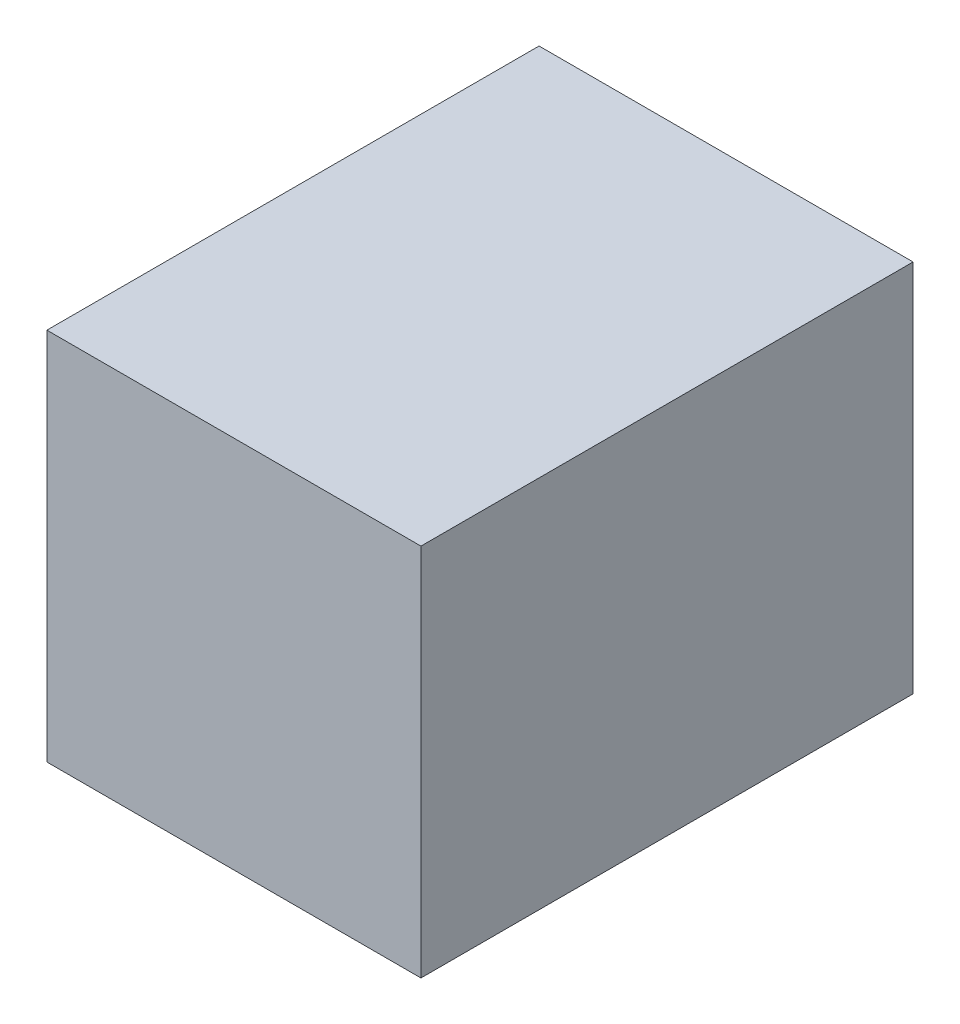
ISO-10303-21;
HEADER;
FILE_DESCRIPTION(('STEP AP214'),'2;1');
FILE_NAME('part.step','',(''),(''),'','','');
FILE_SCHEMA(('AUTOMOTIVE_DESIGN { 1 0 10303 214 1 1 1 1 }'));
ENDSEC;
DATA;
#1=APPLICATION_CONTEXT('core data for automotive mechanical design processes');
#2=APPLICATION_PROTOCOL_DEFINITION('international standard','automotive_design',2000,#1);
#3=PRODUCT_CONTEXT('',#1,'mechanical');
#4=PRODUCT('Part','Part','',(#3));
#5=PRODUCT_RELATED_PRODUCT_CATEGORY('part','',(#4));
#6=PRODUCT_DEFINITION_FORMATION('','',#4);
#7=PRODUCT_DEFINITION_CONTEXT('part definition',#1,'design');
#8=PRODUCT_DEFINITION('design','',#6,#7);
#9=PRODUCT_DEFINITION_SHAPE('','',#8);
#10=(LENGTH_UNIT() NAMED_UNIT(*) SI_UNIT(.MILLI.,.METRE.));
#11=(NAMED_UNIT(*) PLANE_ANGLE_UNIT() SI_UNIT($,.RADIAN.));
#12=(NAMED_UNIT(*) SI_UNIT($,.STERADIAN.) SOLID_ANGLE_UNIT());
#13=UNCERTAINTY_MEASURE_WITH_UNIT(LENGTH_MEASURE(1.E-05),#10,'distance_accuracy_value','');
#14=(GEOMETRIC_REPRESENTATION_CONTEXT(3) GLOBAL_UNCERTAINTY_ASSIGNED_CONTEXT((#13)) GLOBAL_UNIT_ASSIGNED_CONTEXT((#10,
#11,#12)) REPRESENTATION_CONTEXT('',''));
#15=CARTESIAN_POINT('',(0.,0.,0.));
#16=DIRECTION('',(0.,0.,1.));
#17=DIRECTION('',(1.,0.,0.));
#18=AXIS2_PLACEMENT_3D('',#15,#16,#17);
#19=CARTESIAN_POINT('',(-259.500000000003,209.999999999999,12.5));
#20=DIRECTION('',(0.,1.,0.));
#21=DIRECTION('',(0.,0.,1.));
#22=AXIS2_PLACEMENT_3D('',#19,#20,#21);
#23=PLANE('',#22);
#24=DIRECTION('',(1.,0.,0.));
#25=VECTOR('',#24,1.);
#26=CARTESIAN_POINT('',(-259.500000000003,209.999999999999,-12.5));
#27=LINE('',#26,#25);
#28=CARTESIAN_POINT('',(-259.500000000003,209.999999999999,-12.5));
#29=VERTEX_POINT('',#28);
#30=CARTESIAN_POINT('',(-240.500000000003,209.999999999999,-12.5));
#31=VERTEX_POINT('',#30);
#32=EDGE_CURVE('E102',#29,#31,#27,.T.);
#33=ORIENTED_EDGE('',*,*,#32,.T.);
#34=DIRECTION('',(0.,0.,-1.));
#35=VECTOR('',#34,1.);
#36=CARTESIAN_POINT('',(-240.500000000003,209.999999999999,12.5));
#37=LINE('',#36,#35);
#38=CARTESIAN_POINT('',(-240.500000000003,209.999999999999,12.5));
#39=VERTEX_POINT('',#38);
#40=EDGE_CURVE('E11',#39,#31,#37,.T.);
#41=ORIENTED_EDGE('',*,*,#40,.F.);
#42=DIRECTION('',(1.,0.,0.));
#43=VECTOR('',#42,1.);
#44=CARTESIAN_POINT('',(-259.500000000003,209.999999999999,12.5));
#45=LINE('',#44,#43);
#46=CARTESIAN_POINT('',(-259.500000000003,209.999999999999,12.5));
#47=VERTEX_POINT('',#46);
#48=EDGE_CURVE('E90',#47,#39,#45,.T.);
#49=ORIENTED_EDGE('',*,*,#48,.F.);
#50=DIRECTION('',(0.,0.,-1.));
#51=VECTOR('',#50,1.);
#52=CARTESIAN_POINT('',(-259.500000000003,209.999999999999,12.5));
#53=LINE('',#52,#51);
#54=EDGE_CURVE('E98',#47,#29,#53,.T.);
#55=ORIENTED_EDGE('',*,*,#54,.T.);
#56=EDGE_LOOP('',(#33,#41,#49,#55));
#57=FACE_BOUND('',#56,.T.);
#58=ADVANCED_FACE('F39',(#57),#23,.F.);
#59=CARTESIAN_POINT('',(-240.500000000003,209.999999999999,12.5));
#60=DIRECTION('',(-1.,0.,0.));
#61=DIRECTION('',(0.,0.,1.));
#62=AXIS2_PLACEMENT_3D('',#59,#60,#61);
#63=PLANE('',#62);
#64=DIRECTION('',(0.,1.,0.));
#65=VECTOR('',#64,1.);
#66=CARTESIAN_POINT('',(-240.500000000003,209.999999999999,-12.5));
#67=LINE('',#66,#65);
#68=CARTESIAN_POINT('',(-240.500000000003,228.999999999999,-12.5));
#69=VERTEX_POINT('',#68);
#70=EDGE_CURVE('E94',#31,#69,#67,.T.);
#71=ORIENTED_EDGE('',*,*,#70,.T.);
#72=DIRECTION('',(0.,0.,-1.));
#73=VECTOR('',#72,1.);
#74=CARTESIAN_POINT('',(-240.500000000003,228.999999999999,12.5));
#75=LINE('',#74,#73);
#76=CARTESIAN_POINT('',(-240.500000000003,228.999999999999,12.5));
#77=VERTEX_POINT('',#76);
#78=EDGE_CURVE('E47',#77,#69,#75,.T.);
#79=ORIENTED_EDGE('',*,*,#78,.F.);
#80=DIRECTION('',(0.,1.,0.));
#81=VECTOR('',#80,1.);
#82=CARTESIAN_POINT('',(-240.500000000003,209.999999999999,12.5));
#83=LINE('',#82,#81);
#84=EDGE_CURVE('E85',#39,#77,#83,.T.);
#85=ORIENTED_EDGE('',*,*,#84,.F.);
#86=ORIENTED_EDGE('',*,*,#40,.T.);
#87=EDGE_LOOP('',(#71,#79,#85,#86));
#88=FACE_BOUND('',#87,.T.);
#89=ADVANCED_FACE('F93',(#88),#63,.F.);
#90=CARTESIAN_POINT('',(-240.500000000003,228.999999999999,12.5));
#91=DIRECTION('',(0.,-1.,0.));
#92=DIRECTION('',(0.,0.,-1.));
#93=AXIS2_PLACEMENT_3D('',#90,#91,#92);
#94=PLANE('',#93);
#95=DIRECTION('',(-1.,0.,0.));
#96=VECTOR('',#95,1.);
#97=CARTESIAN_POINT('',(-240.500000000003,228.999999999999,-12.5));
#98=LINE('',#97,#96);
#99=CARTESIAN_POINT('',(-259.500000000003,228.999999999999,-12.5));
#100=VERTEX_POINT('',#99);
#101=EDGE_CURVE('E72',#69,#100,#98,.T.);
#102=ORIENTED_EDGE('',*,*,#101,.T.);
#103=DIRECTION('',(0.,0.,-1.));
#104=VECTOR('',#103,1.);
#105=CARTESIAN_POINT('',(-259.500000000003,228.999999999999,12.5));
#106=LINE('',#105,#104);
#107=CARTESIAN_POINT('',(-259.500000000003,228.999999999999,12.5));
#108=VERTEX_POINT('',#107);
#109=EDGE_CURVE('E95',#108,#100,#106,.T.);
#110=ORIENTED_EDGE('',*,*,#109,.F.);
#111=DIRECTION('',(-1.,0.,0.));
#112=VECTOR('',#111,1.);
#113=CARTESIAN_POINT('',(-240.500000000003,228.999999999999,12.5));
#114=LINE('',#113,#112);
#115=EDGE_CURVE('E88',#77,#108,#114,.T.);
#116=ORIENTED_EDGE('',*,*,#115,.F.);
#117=ORIENTED_EDGE('',*,*,#78,.T.);
#118=EDGE_LOOP('',(#102,#110,#116,#117));
#119=FACE_BOUND('',#118,.T.);
#120=ADVANCED_FACE('F96',(#119),#94,.F.);
#121=CARTESIAN_POINT('',(-259.500000000003,228.999999999999,12.5));
#122=DIRECTION('',(1.,0.,0.));
#123=DIRECTION('',(0.,0.,-1.));
#124=AXIS2_PLACEMENT_3D('',#121,#122,#123);
#125=PLANE('',#124);
#126=DIRECTION('',(0.,-1.,0.));
#127=VECTOR('',#126,1.);
#128=CARTESIAN_POINT('',(-259.500000000003,228.999999999999,-12.5));
#129=LINE('',#128,#127);
#130=EDGE_CURVE('E78',#100,#29,#129,.T.);
#131=ORIENTED_EDGE('',*,*,#130,.T.);
#132=ORIENTED_EDGE('',*,*,#54,.F.);
#133=DIRECTION('',(0.,-1.,0.));
#134=VECTOR('',#133,1.);
#135=CARTESIAN_POINT('',(-259.500000000003,228.999999999999,12.5));
#136=LINE('',#135,#134);
#137=EDGE_CURVE('E55',#108,#47,#136,.T.);
#138=ORIENTED_EDGE('',*,*,#137,.F.);
#139=ORIENTED_EDGE('',*,*,#109,.T.);
#140=EDGE_LOOP('',(#131,#132,#138,#139));
#141=FACE_BOUND('',#140,.T.);
#142=ADVANCED_FACE('F109',(#141),#125,.F.);
#143=CARTESIAN_POINT('',(0.,0.,12.5));
#144=DIRECTION('',(0.,0.,1.));
#145=DIRECTION('',(1.,0.,0.));
#146=AXIS2_PLACEMENT_3D('',#143,#144,#145);
#147=PLANE('',#146);
#148=ORIENTED_EDGE('',*,*,#48,.T.);
#149=ORIENTED_EDGE('',*,*,#84,.T.);
#150=ORIENTED_EDGE('',*,*,#115,.T.);
#151=ORIENTED_EDGE('',*,*,#137,.T.);
#152=EDGE_LOOP('',(#148,#149,#150,#151));
#153=FACE_BOUND('',#152,.T.);
#154=ADVANCED_FACE('F86',(#153),#147,.T.);
#155=CARTESIAN_POINT('',(0.,0.,-12.5));
#156=DIRECTION('',(0.,0.,1.));
#157=DIRECTION('',(1.,0.,0.));
#158=AXIS2_PLACEMENT_3D('',#155,#156,#157);
#159=PLANE('',#158);
#160=ORIENTED_EDGE('',*,*,#32,.F.);
#161=ORIENTED_EDGE('',*,*,#130,.F.);
#162=ORIENTED_EDGE('',*,*,#101,.F.);
#163=ORIENTED_EDGE('',*,*,#70,.F.);
#164=EDGE_LOOP('',(#160,#161,#162,#163));
#165=FACE_BOUND('',#164,.T.);
#166=ADVANCED_FACE('F112',(#165),#159,.F.);
#167=CLOSED_SHELL('',(#58,#89,#120,#142,#154,#166));
#168=MANIFOLD_SOLID_BREP('B2',#167);
#169=ADVANCED_BREP_SHAPE_REPRESENTATION('',(#18,#168),#14);
#170=SHAPE_DEFINITION_REPRESENTATION(#9,#169);
ENDSEC;
END-ISO-10303-21;
